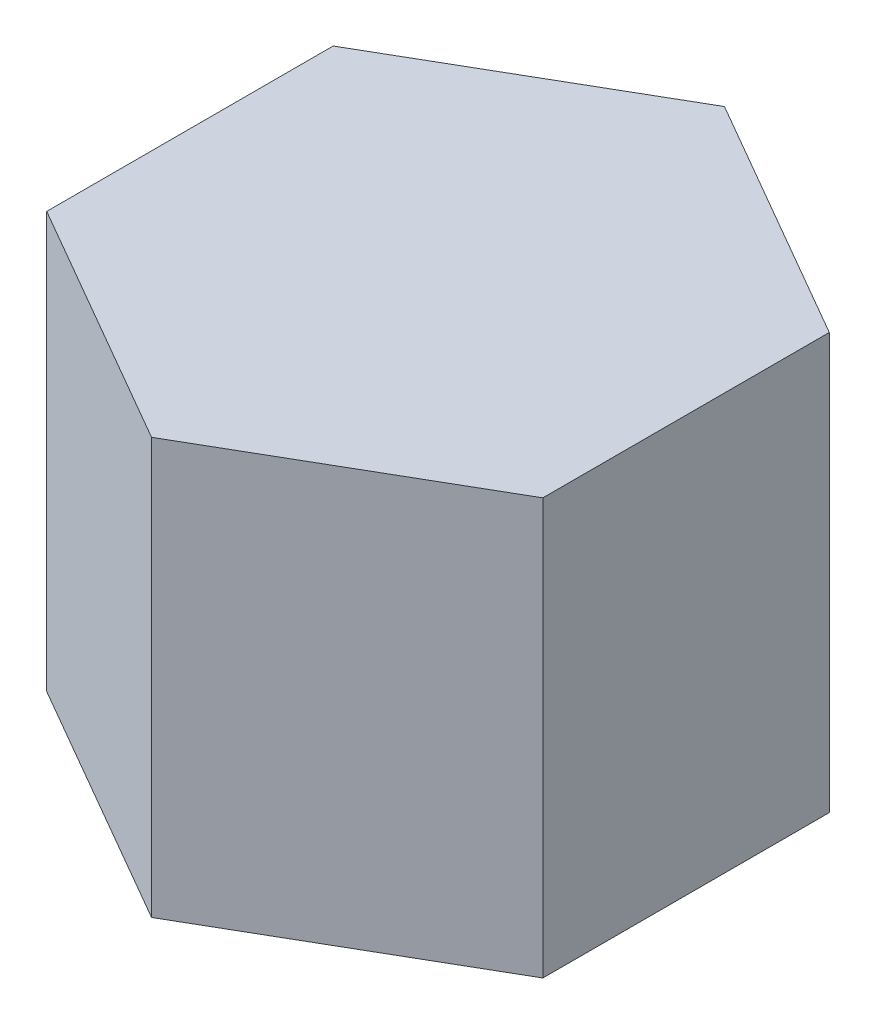
ISO-10303-21;
HEADER;
FILE_DESCRIPTION(('STEP AP214'),'2;1');
FILE_NAME('part.step','',(''),(''),'','','');
FILE_SCHEMA(('AUTOMOTIVE_DESIGN { 1 0 10303 214 1 1 1 1 }'));
ENDSEC;
DATA;
#1=APPLICATION_CONTEXT('core data for automotive mechanical design processes');
#2=APPLICATION_PROTOCOL_DEFINITION('international standard','automotive_design',2000,#1);
#3=PRODUCT_CONTEXT('',#1,'mechanical');
#4=PRODUCT('Part','Part','',(#3));
#5=PRODUCT_RELATED_PRODUCT_CATEGORY('part','',(#4));
#6=PRODUCT_DEFINITION_FORMATION('','',#4);
#7=PRODUCT_DEFINITION_CONTEXT('part definition',#1,'design');
#8=PRODUCT_DEFINITION('design','',#6,#7);
#9=PRODUCT_DEFINITION_SHAPE('','',#8);
#10=(LENGTH_UNIT() NAMED_UNIT(*) SI_UNIT(.MILLI.,.METRE.));
#11=(NAMED_UNIT(*) PLANE_ANGLE_UNIT() SI_UNIT($,.RADIAN.));
#12=(NAMED_UNIT(*) SI_UNIT($,.STERADIAN.) SOLID_ANGLE_UNIT());
#13=UNCERTAINTY_MEASURE_WITH_UNIT(LENGTH_MEASURE(1.E-05),#10,'distance_accuracy_value','');
#14=(GEOMETRIC_REPRESENTATION_CONTEXT(3) GLOBAL_UNCERTAINTY_ASSIGNED_CONTEXT((#13)) GLOBAL_UNIT_ASSIGNED_CONTEXT((#10,
#11,#12)) REPRESENTATION_CONTEXT('',''));
#15=CARTESIAN_POINT('',(0.,0.,0.));
#16=DIRECTION('',(0.,0.,1.));
#17=DIRECTION('',(1.,0.,0.));
#18=AXIS2_PLACEMENT_3D('',#15,#16,#17);
#19=CARTESIAN_POINT('',(210.642660308706,-148.537700895744,288.042869605357));
#20=DIRECTION('',(-0.499999999999943,0.,-0.866025403784472));
#21=DIRECTION('',(-0.866025403784472,0.,0.499999999999943));
#22=AXIS2_PLACEMENT_3D('',#19,#20,#21);
#23=PLANE('',#22);
#24=CARTESIAN_POINT('',(210.339551417382,-149.045793579175,288.217869605357));
#25=DIRECTION('',(0.866025403784471,0.,-0.499999999999943));
#26=VECTOR('',#25,1.);
#27=LINE('',#24,#26);
#28=CARTESIAN_POINT('',(210.339551417382,-149.045793579175,288.217869605357));
#29=VERTEX_POINT('',#28);
#30=CARTESIAN_POINT('',(210.642660308706,-149.045793579175,288.042869605357));
#31=VERTEX_POINT('',#30);
#32=EDGE_CURVE('E170',#29,#31,#27,.T.);
#33=ORIENTED_EDGE('',*,*,#32,.T.);
#34=CARTESIAN_POINT('',(210.642660308706,-148.537700895744,288.042869605357));
#35=DIRECTION('',(0.,-1.,0.));
#36=VECTOR('',#35,1.);
#37=LINE('',#34,#36);
#38=CARTESIAN_POINT('',(210.642660308706,-148.537700895744,288.042869605357));
#39=VERTEX_POINT('',#38);
#40=EDGE_CURVE('E35',#39,#31,#37,.T.);
#41=ORIENTED_EDGE('',*,*,#40,.F.);
#42=CARTESIAN_POINT('',(210.339551417382,-148.537700895744,288.217869605357));
#43=DIRECTION('',(0.866025403784471,0.,-0.499999999999943));
#44=VECTOR('',#43,1.);
#45=LINE('',#42,#44);
#46=CARTESIAN_POINT('',(210.339551417382,-148.537700895744,288.217869605357));
#47=VERTEX_POINT('',#46);
#48=EDGE_CURVE('E159',#47,#39,#45,.T.);
#49=ORIENTED_EDGE('',*,*,#48,.F.);
#50=CARTESIAN_POINT('',(210.339551417382,-148.537700895744,288.217869605357));
#51=DIRECTION('',(0.,-1.,0.));
#52=VECTOR('',#51,1.);
#53=LINE('',#50,#52);
#54=EDGE_CURVE('E10',#47,#29,#53,.T.);
#55=ORIENTED_EDGE('',*,*,#54,.T.);
#56=EDGE_LOOP('',(#33,#41,#49,#55));
#57=FACE_BOUND('',#56,.T.);
#58=ADVANCED_FACE('F16',(#57),#23,.F.);
#59=CARTESIAN_POINT('',(210.339551417382,-148.537700895744,288.217869605357));
#60=DIRECTION('',(0.500000000000062,0.,-0.866025403784403));
#61=DIRECTION('',(-0.866025403784403,0.,-0.500000000000062));
#62=AXIS2_PLACEMENT_3D('',#59,#60,#61);
#63=PLANE('',#62);
#64=CARTESIAN_POINT('',(210.036442526057,-149.045793579175,288.042869605357));
#65=DIRECTION('',(0.866025403784403,0.,0.500000000000062));
#66=VECTOR('',#65,1.);
#67=LINE('',#64,#66);
#68=CARTESIAN_POINT('',(210.036442526057,-149.045793579175,288.042869605357));
#69=VERTEX_POINT('',#68);
#70=EDGE_CURVE('E167',#69,#29,#67,.T.);
#71=ORIENTED_EDGE('',*,*,#70,.T.);
#72=ORIENTED_EDGE('',*,*,#54,.F.);
#73=CARTESIAN_POINT('',(210.036442526057,-148.537700895744,288.042869605357));
#74=DIRECTION('',(0.866025403784403,0.,0.500000000000062));
#75=VECTOR('',#74,1.);
#76=LINE('',#73,#75);
#77=CARTESIAN_POINT('',(210.036442526057,-148.537700895744,288.042869605357));
#78=VERTEX_POINT('',#77);
#79=EDGE_CURVE('E156',#78,#47,#76,.T.);
#80=ORIENTED_EDGE('',*,*,#79,.F.);
#81=CARTESIAN_POINT('',(210.036442526057,-148.537700895744,288.042869605357));
#82=DIRECTION('',(0.,-1.,0.));
#83=VECTOR('',#82,1.);
#84=LINE('',#81,#83);
#85=EDGE_CURVE('E27',#78,#69,#84,.T.);
#86=ORIENTED_EDGE('',*,*,#85,.T.);
#87=EDGE_LOOP('',(#71,#72,#80,#86));
#88=FACE_BOUND('',#87,.T.);
#89=ADVANCED_FACE('F189',(#88),#63,.F.);
#90=CARTESIAN_POINT('',(210.036442526057,-148.537700895744,290.831971220494));
#91=DIRECTION('',(1.,0.,0.));
#92=DIRECTION('',(0.,1.,0.));
#93=AXIS2_PLACEMENT_3D('',#90,#91,#92);
#94=PLANE('',#93);
#95=CARTESIAN_POINT('',(210.036442526057,-149.045793579175,287.692869605357));
#96=DIRECTION('',(0.,0.,1.));
#97=VECTOR('',#96,1.);
#98=LINE('',#95,#97);
#99=CARTESIAN_POINT('',(210.036442526057,-149.045793579175,287.692869605357));
#100=VERTEX_POINT('',#99);
#101=EDGE_CURVE('E163',#100,#69,#98,.T.);
#102=ORIENTED_EDGE('',*,*,#101,.T.);
#103=ORIENTED_EDGE('',*,*,#85,.F.);
#104=CARTESIAN_POINT('',(210.036442526057,-148.537700895744,287.692869605357));
#105=DIRECTION('',(0.,0.,1.));
#106=VECTOR('',#105,1.);
#107=LINE('',#104,#106);
#108=CARTESIAN_POINT('',(210.036442526057,-148.537700895744,287.692869605357));
#109=VERTEX_POINT('',#108);
#110=EDGE_CURVE('E106',#109,#78,#107,.T.);
#111=ORIENTED_EDGE('',*,*,#110,.F.);
#112=CARTESIAN_POINT('',(210.036442526057,-148.537700895744,287.692869605357));
#113=DIRECTION('',(0.,-1.,0.));
#114=VECTOR('',#113,1.);
#115=LINE('',#112,#114);
#116=EDGE_CURVE('E94',#109,#100,#115,.T.);
#117=ORIENTED_EDGE('',*,*,#116,.T.);
#118=EDGE_LOOP('',(#102,#103,#111,#117));
#119=FACE_BOUND('',#118,.T.);
#120=ADVANCED_FACE('F198',(#119),#94,.F.);
#121=CARTESIAN_POINT('',(210.036442526057,-148.537700895744,287.692869605357));
#122=DIRECTION('',(0.499999999999978,0.,0.866025403784452));
#123=DIRECTION('',(0.866025403784452,0.,-0.499999999999978));
#124=AXIS2_PLACEMENT_3D('',#121,#122,#123);
#125=PLANE('',#124);
#126=CARTESIAN_POINT('',(210.339551417382,-149.045793579175,287.517869605357));
#127=DIRECTION('',(-0.866025403784452,0.,0.499999999999978));
#128=VECTOR('',#127,1.);
#129=LINE('',#126,#128);
#130=CARTESIAN_POINT('',(210.339551417382,-149.045793579175,287.517869605357));
#131=VERTEX_POINT('',#130);
#132=EDGE_CURVE('E162',#131,#100,#129,.T.);
#133=ORIENTED_EDGE('',*,*,#132,.T.);
#134=ORIENTED_EDGE('',*,*,#116,.F.);
#135=CARTESIAN_POINT('',(210.339551417382,-148.537700895744,287.517869605357));
#136=DIRECTION('',(-0.866025403784452,0.,0.499999999999978));
#137=VECTOR('',#136,1.);
#138=LINE('',#135,#137);
#139=CARTESIAN_POINT('',(210.339551417382,-148.537700895744,287.517869605357));
#140=VERTEX_POINT('',#139);
#141=EDGE_CURVE('E98',#140,#109,#138,.T.);
#142=ORIENTED_EDGE('',*,*,#141,.F.);
#143=CARTESIAN_POINT('',(210.339551417382,-148.537700895744,287.517869605357));
#144=DIRECTION('',(0.,-1.,0.));
#145=VECTOR('',#144,1.);
#146=LINE('',#143,#145);
#147=EDGE_CURVE('E79',#140,#131,#146,.T.);
#148=ORIENTED_EDGE('',*,*,#147,.T.);
#149=EDGE_LOOP('',(#133,#134,#142,#148));
#150=FACE_BOUND('',#149,.T.);
#151=ADVANCED_FACE('F100',(#150),#125,.F.);
#152=CARTESIAN_POINT('',(210.339551417382,-148.537700895744,287.517869605357));
#153=DIRECTION('',(-0.499999999999943,0.,0.866025403784472));
#154=DIRECTION('',(0.866025403784472,0.,0.499999999999943));
#155=AXIS2_PLACEMENT_3D('',#152,#153,#154);
#156=PLANE('',#155);
#157=CARTESIAN_POINT('',(210.642660308706,-149.045793579175,287.692869605357));
#158=DIRECTION('',(-0.866025403784471,0.,-0.499999999999943));
#159=VECTOR('',#158,1.);
#160=LINE('',#157,#159);
#161=CARTESIAN_POINT('',(210.642660308706,-149.045793579175,287.692869605357));
#162=VERTEX_POINT('',#161);
#163=EDGE_CURVE('E88',#162,#131,#160,.T.);
#164=ORIENTED_EDGE('',*,*,#163,.T.);
#165=ORIENTED_EDGE('',*,*,#147,.F.);
#166=CARTESIAN_POINT('',(210.642660308706,-148.537700895744,287.692869605357));
#167=DIRECTION('',(-0.866025403784471,0.,-0.499999999999943));
#168=VECTOR('',#167,1.);
#169=LINE('',#166,#168);
#170=CARTESIAN_POINT('',(210.642660308706,-148.537700895744,287.692869605357));
#171=VERTEX_POINT('',#170);
#172=EDGE_CURVE('E84',#171,#140,#169,.T.);
#173=ORIENTED_EDGE('',*,*,#172,.F.);
#174=CARTESIAN_POINT('',(210.642660308706,-148.537700895744,287.692869605357));
#175=DIRECTION('',(0.,-1.,0.));
#176=VECTOR('',#175,1.);
#177=LINE('',#174,#176);
#178=EDGE_CURVE('E58',#171,#162,#177,.T.);
#179=ORIENTED_EDGE('',*,*,#178,.T.);
#180=EDGE_LOOP('',(#164,#165,#173,#179));
#181=FACE_BOUND('',#180,.T.);
#182=ADVANCED_FACE('F82',(#181),#156,.F.);
#183=CARTESIAN_POINT('',(210.642660308706,-148.537700895744,290.831971220494));
#184=DIRECTION('',(-1.,0.,0.));
#185=DIRECTION('',(0.,-1.,0.));
#186=AXIS2_PLACEMENT_3D('',#183,#184,#185);
#187=PLANE('',#186);
#188=CARTESIAN_POINT('',(210.642660308706,-149.045793579175,288.042869605357));
#189=DIRECTION('',(0.,0.,-1.));
#190=VECTOR('',#189,1.);
#191=LINE('',#188,#190);
#192=EDGE_CURVE('E160',#31,#162,#191,.T.);
#193=ORIENTED_EDGE('',*,*,#192,.T.);
#194=ORIENTED_EDGE('',*,*,#178,.F.);
#195=CARTESIAN_POINT('',(210.642660308706,-148.537700895744,288.042869605357));
#196=DIRECTION('',(0.,0.,-1.));
#197=VECTOR('',#196,1.);
#198=LINE('',#195,#197);
#199=EDGE_CURVE('E112',#39,#171,#198,.T.);
#200=ORIENTED_EDGE('',*,*,#199,.F.);
#201=ORIENTED_EDGE('',*,*,#40,.T.);
#202=EDGE_LOOP('',(#193,#194,#200,#201));
#203=FACE_BOUND('',#202,.T.);
#204=ADVANCED_FACE('F131',(#203),#187,.F.);
#205=CARTESIAN_POINT('',(206.339551417382,-148.537700895744,290.831971220494));
#206=DIRECTION('',(0.,-1.,0.));
#207=DIRECTION('',(1.,0.,0.));
#208=AXIS2_PLACEMENT_3D('',#205,#206,#207);
#209=PLANE('',#208);
#210=ORIENTED_EDGE('',*,*,#48,.T.);
#211=ORIENTED_EDGE('',*,*,#199,.T.);
#212=ORIENTED_EDGE('',*,*,#172,.T.);
#213=ORIENTED_EDGE('',*,*,#141,.T.);
#214=ORIENTED_EDGE('',*,*,#110,.T.);
#215=ORIENTED_EDGE('',*,*,#79,.T.);
#216=EDGE_LOOP('',(#210,#211,#212,#213,#214,#215));
#217=FACE_BOUND('',#216,.T.);
#218=ADVANCED_FACE('F111',(#217),#209,.F.);
#219=CARTESIAN_POINT('',(206.339551417382,-149.045793579175,290.831971220494));
#220=DIRECTION('',(0.,-1.,0.));
#221=DIRECTION('',(1.,0.,0.));
#222=AXIS2_PLACEMENT_3D('',#219,#220,#221);
#223=PLANE('',#222);
#224=ORIENTED_EDGE('',*,*,#32,.F.);
#225=ORIENTED_EDGE('',*,*,#70,.F.);
#226=ORIENTED_EDGE('',*,*,#101,.F.);
#227=ORIENTED_EDGE('',*,*,#132,.F.);
#228=ORIENTED_EDGE('',*,*,#163,.F.);
#229=ORIENTED_EDGE('',*,*,#192,.F.);
#230=EDGE_LOOP('',(#224,#225,#226,#227,#228,#229));
#231=FACE_BOUND('',#230,.T.);
#232=ADVANCED_FACE('F130',(#231),#223,.T.);
#233=CLOSED_SHELL('',(#58,#89,#120,#151,#182,#204,#218,#232));
#234=MANIFOLD_SOLID_BREP('B1',#233);
#235=ADVANCED_BREP_SHAPE_REPRESENTATION('',(#18,#234),#14);
#236=SHAPE_DEFINITION_REPRESENTATION(#9,#235);
ENDSEC;
END-ISO-10303-21;
